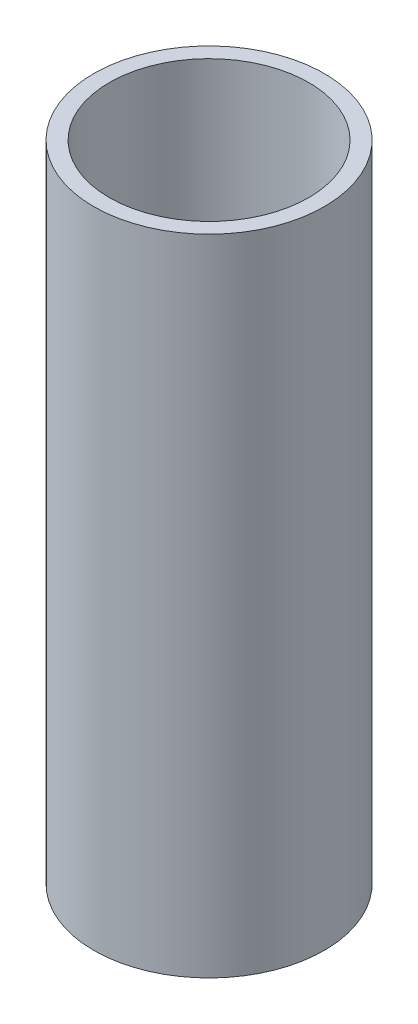
ISO-10303-21;
HEADER;
FILE_DESCRIPTION(('STEP AP214'),'2;1');
FILE_NAME('part.step','',(''),(''),'','','');
FILE_SCHEMA(('AUTOMOTIVE_DESIGN { 1 0 10303 214 1 1 1 1 }'));
ENDSEC;
DATA;
#1=APPLICATION_CONTEXT('core data for automotive mechanical design processes');
#2=APPLICATION_PROTOCOL_DEFINITION('international standard','automotive_design',2000,#1);
#3=PRODUCT_CONTEXT('',#1,'mechanical');
#4=PRODUCT('Part','Part','',(#3));
#5=PRODUCT_RELATED_PRODUCT_CATEGORY('part','',(#4));
#6=PRODUCT_DEFINITION_FORMATION('','',#4);
#7=PRODUCT_DEFINITION_CONTEXT('part definition',#1,'design');
#8=PRODUCT_DEFINITION('design','',#6,#7);
#9=PRODUCT_DEFINITION_SHAPE('','',#8);
#10=(LENGTH_UNIT() NAMED_UNIT(*) SI_UNIT(.MILLI.,.METRE.));
#11=(NAMED_UNIT(*) PLANE_ANGLE_UNIT() SI_UNIT($,.RADIAN.));
#12=(NAMED_UNIT(*) SI_UNIT($,.STERADIAN.) SOLID_ANGLE_UNIT());
#13=UNCERTAINTY_MEASURE_WITH_UNIT(LENGTH_MEASURE(1.E-05),#10,'distance_accuracy_value','');
#14=(GEOMETRIC_REPRESENTATION_CONTEXT(3) GLOBAL_UNCERTAINTY_ASSIGNED_CONTEXT((#13)) GLOBAL_UNIT_ASSIGNED_CONTEXT((#10,
#11,#12)) REPRESENTATION_CONTEXT('',''));
#15=CARTESIAN_POINT('',(0.,0.,0.));
#16=DIRECTION('',(0.,0.,1.));
#17=DIRECTION('',(1.,0.,0.));
#18=AXIS2_PLACEMENT_3D('',#15,#16,#17);
#19=CARTESIAN_POINT('',(0.,167.611797927017,0.));
#20=DIRECTION('',(0.,-1.,0.));
#21=DIRECTION('',(0.,0.,-1.));
#22=AXIS2_PLACEMENT_3D('',#19,#20,#21);
#23=CYLINDRICAL_SURFACE('',#22,30.);
#24=CARTESIAN_POINT('',(0.,167.611797927017,0.));
#25=DIRECTION('',(0.,1.,0.));
#26=DIRECTION('',(0.,0.,1.));
#27=AXIS2_PLACEMENT_3D('',#24,#25,#26);
#28=CIRCLE('',#27,30.);
#29=CARTESIAN_POINT('',(0.,167.611797927017,30.));
#30=VERTEX_POINT('',#29);
#31=EDGE_CURVE('E10',#30,#30,#28,.T.);
#32=ORIENTED_EDGE('',*,*,#31,.F.);
#33=EDGE_LOOP('',(#32));
#34=FACE_BOUND('',#33,.T.);
#35=CARTESIAN_POINT('',(0.,0.,0.));
#36=DIRECTION('',(0.,1.,0.));
#37=DIRECTION('',(0.,0.,1.));
#38=AXIS2_PLACEMENT_3D('',#35,#36,#37);
#39=CIRCLE('',#38,30.);
#40=CARTESIAN_POINT('',(0.,0.,30.));
#41=VERTEX_POINT('',#40);
#42=EDGE_CURVE('E37',#41,#41,#39,.T.);
#43=ORIENTED_EDGE('',*,*,#42,.T.);
#44=EDGE_LOOP('',(#43));
#45=FACE_BOUND('',#44,.T.);
#46=ADVANCED_FACE('F40',(#34,#45),#23,.T.);
#47=CARTESIAN_POINT('',(0.,167.611797927017,0.));
#48=DIRECTION('',(0.,1.,0.));
#49=DIRECTION('',(0.,0.,1.));
#50=AXIS2_PLACEMENT_3D('',#47,#48,#49);
#51=PLANE('',#50);
#52=CARTESIAN_POINT('',(0.,167.611797927017,0.));
#53=DIRECTION('',(0.,1.,0.));
#54=DIRECTION('',(0.,0.,1.));
#55=AXIS2_PLACEMENT_3D('',#52,#53,#54);
#56=CIRCLE('',#55,25.9483916984443);
#57=CARTESIAN_POINT('',(0.,167.611797927017,25.9483916984443));
#58=VERTEX_POINT('',#57);
#59=EDGE_CURVE('E50',#58,#58,#56,.T.);
#60=ORIENTED_EDGE('',*,*,#59,.F.);
#61=EDGE_LOOP('',(#60));
#62=FACE_BOUND('',#61,.T.);
#63=ORIENTED_EDGE('',*,*,#31,.T.);
#64=EDGE_LOOP('',(#63));
#65=FACE_BOUND('',#64,.T.);
#66=ADVANCED_FACE('F59',(#62,#65),#51,.T.);
#67=CARTESIAN_POINT('',(0.,0.,0.));
#68=DIRECTION('',(0.,1.,0.));
#69=DIRECTION('',(0.,0.,1.));
#70=AXIS2_PLACEMENT_3D('',#67,#68,#69);
#71=PLANE('',#70);
#72=CARTESIAN_POINT('',(0.,0.,0.));
#73=DIRECTION('',(0.,1.,0.));
#74=DIRECTION('',(0.,0.,1.));
#75=AXIS2_PLACEMENT_3D('',#72,#73,#74);
#76=CIRCLE('',#75,25.9483916984443);
#77=CARTESIAN_POINT('',(0.,0.,25.9483916984443));
#78=VERTEX_POINT('',#77);
#79=EDGE_CURVE('E47',#78,#78,#76,.T.);
#80=ORIENTED_EDGE('',*,*,#79,.T.);
#81=EDGE_LOOP('',(#80));
#82=FACE_BOUND('',#81,.T.);
#83=ORIENTED_EDGE('',*,*,#42,.F.);
#84=EDGE_LOOP('',(#83));
#85=FACE_BOUND('',#84,.T.);
#86=ADVANCED_FACE('F58',(#82,#85),#71,.F.);
#87=CARTESIAN_POINT('',(0.,167.611797927017,0.));
#88=DIRECTION('',(0.,-1.,0.));
#89=DIRECTION('',(0.,0.,-1.));
#90=AXIS2_PLACEMENT_3D('',#87,#88,#89);
#91=CYLINDRICAL_SURFACE('',#90,25.9483916984443);
#92=ORIENTED_EDGE('',*,*,#59,.T.);
#93=EDGE_LOOP('',(#92));
#94=FACE_BOUND('',#93,.T.);
#95=ORIENTED_EDGE('',*,*,#79,.F.);
#96=EDGE_LOOP('',(#95));
#97=FACE_BOUND('',#96,.T.);
#98=ADVANCED_FACE('F54',(#94,#97),#91,.F.);
#99=CLOSED_SHELL('',(#46,#66,#86,#98));
#100=MANIFOLD_SOLID_BREP('B2',#99);
#101=ADVANCED_BREP_SHAPE_REPRESENTATION('',(#18,#100),#14);
#102=SHAPE_DEFINITION_REPRESENTATION(#9,#101);
ENDSEC;
END-ISO-10303-21;
